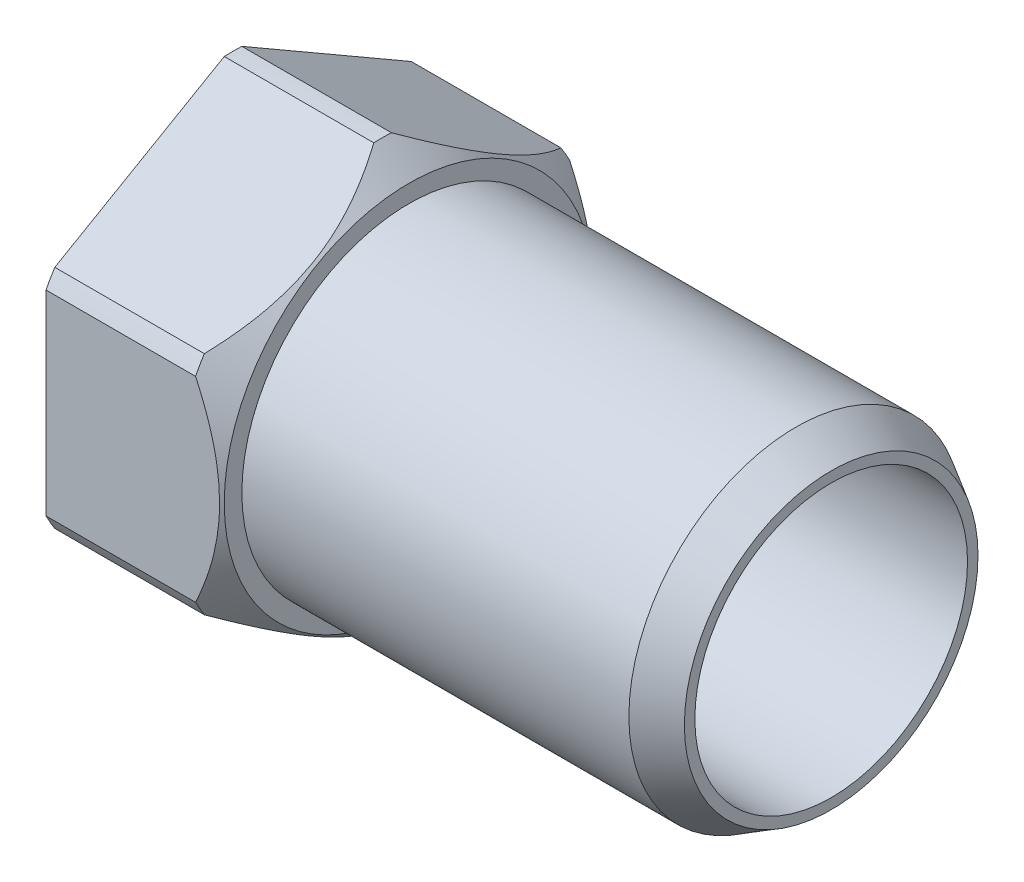
ISO-10303-21;
HEADER;
FILE_DESCRIPTION(('STEP AP214'),'2;1');
FILE_NAME('part.step','',(''),(''),'','','');
FILE_SCHEMA(('AUTOMOTIVE_DESIGN { 1 0 10303 214 1 1 1 1 }'));
ENDSEC;
DATA;
#1=APPLICATION_CONTEXT('core data for automotive mechanical design processes');
#2=APPLICATION_PROTOCOL_DEFINITION('international standard','automotive_design',2000,#1);
#3=PRODUCT_CONTEXT('',#1,'mechanical');
#4=PRODUCT('Part','Part','',(#3));
#5=PRODUCT_RELATED_PRODUCT_CATEGORY('part','',(#4));
#6=PRODUCT_DEFINITION_FORMATION('','',#4);
#7=PRODUCT_DEFINITION_CONTEXT('part definition',#1,'design');
#8=PRODUCT_DEFINITION('design','',#6,#7);
#9=PRODUCT_DEFINITION_SHAPE('','',#8);
#10=(LENGTH_UNIT() NAMED_UNIT(*) SI_UNIT(.MILLI.,.METRE.));
#11=(NAMED_UNIT(*) PLANE_ANGLE_UNIT() SI_UNIT($,.RADIAN.));
#12=(NAMED_UNIT(*) SI_UNIT($,.STERADIAN.) SOLID_ANGLE_UNIT());
#13=UNCERTAINTY_MEASURE_WITH_UNIT(LENGTH_MEASURE(1.E-05),#10,'distance_accuracy_value','');
#14=(GEOMETRIC_REPRESENTATION_CONTEXT(3) GLOBAL_UNCERTAINTY_ASSIGNED_CONTEXT((#13)) GLOBAL_UNIT_ASSIGNED_CONTEXT((#10,
#11,#12)) REPRESENTATION_CONTEXT('',''));
#15=CARTESIAN_POINT('',(0.,0.,0.));
#16=DIRECTION('',(0.,0.,1.));
#17=DIRECTION('',(1.,0.,0.));
#18=AXIS2_PLACEMENT_3D('',#15,#16,#17);
#19=CARTESIAN_POINT('',(0.,0.609600000000002,0.));
#20=DIRECTION('',(1.,0.,0.));
#21=DIRECTION('',(0.,0.,-1.));
#22=AXIS2_PLACEMENT_3D('',#19,#20,#21);
#23=PLANE('',#22);
#24=CARTESIAN_POINT('',(0.,0.,0.));
#25=DIRECTION('',(-1.,0.,0.));
#26=DIRECTION('',(0.,0.,1.));
#27=AXIS2_PLACEMENT_3D('',#24,#25,#26);
#28=CIRCLE('',#27,0.4826);
#29=CARTESIAN_POINT('',(0.,0.,0.4826));
#30=VERTEX_POINT('',#29);
#31=EDGE_CURVE('E238',#30,#30,#28,.T.);
#32=ORIENTED_EDGE('',*,*,#31,.F.);
#33=EDGE_LOOP('',(#32));
#34=FACE_BOUND('',#33,.T.);
#35=DIRECTION('',(0.,0.499999999999999,-0.866025403784439));
#36=VECTOR('',#35,1.);
#37=CARTESIAN_POINT('',(0.,0.609070603460717,0.0254));
#38=LINE('',#37,#36);
#39=CARTESIAN_POINT('',(0.,0.326532346986484,0.514770615295299));
#40=VERTEX_POINT('',#39);
#41=CARTESIAN_POINT('',(0.,0.609070603460717,0.0254));
#42=VERTEX_POINT('',#41);
#43=EDGE_CURVE('E242',#40,#42,#38,.T.);
#44=ORIENTED_EDGE('',*,*,#43,.T.);
#45=CARTESIAN_POINT('',(0.,0.,0.));
#46=DIRECTION('',(-1.,0.,0.));
#47=DIRECTION('',(0.,0.,1.));
#48=AXIS2_PLACEMENT_3D('',#45,#46,#47);
#49=CIRCLE('',#48,0.609600000000002);
#50=CARTESIAN_POINT('',(0.,0.609070603460717,-0.0254));
#51=VERTEX_POINT('',#50);
#52=EDGE_CURVE('E130',#42,#51,#49,.T.);
#53=ORIENTED_EDGE('',*,*,#52,.T.);
#54=DIRECTION('',(0.,-0.500000000000003,-0.866025403784437));
#55=VECTOR('',#54,1.);
#56=CARTESIAN_POINT('',(0.,0.326532346986479,-0.514770615295302));
#57=LINE('',#56,#55);
#58=CARTESIAN_POINT('',(0.,0.326532346986479,-0.514770615295302));
#59=VERTEX_POINT('',#58);
#60=EDGE_CURVE('E112',#51,#59,#57,.T.);
#61=ORIENTED_EDGE('',*,*,#60,.T.);
#62=CARTESIAN_POINT('',(0.,0.28253825647423,-0.540170615295301));
#63=VERTEX_POINT('',#62);
#64=EDGE_CURVE('E128',#59,#63,#49,.T.);
#65=ORIENTED_EDGE('',*,*,#64,.T.);
#66=DIRECTION('',(0.,-1.,0.));
#67=VECTOR('',#66,1.);
#68=CARTESIAN_POINT('',(0.,0.28253825647423,-0.540170615295301));
#69=LINE('',#68,#67);
#70=CARTESIAN_POINT('',(0.,-0.282538256474235,-0.540170615295299));
#71=VERTEX_POINT('',#70);
#72=EDGE_CURVE('E131',#63,#71,#69,.T.);
#73=ORIENTED_EDGE('',*,*,#72,.T.);
#74=CARTESIAN_POINT('',(0.,-0.326532346986484,-0.514770615295299));
#75=VERTEX_POINT('',#74);
#76=EDGE_CURVE('E135',#71,#75,#49,.T.);
#77=ORIENTED_EDGE('',*,*,#76,.T.);
#78=DIRECTION('',(0.,-0.499999999999999,0.866025403784439));
#79=VECTOR('',#78,1.);
#80=CARTESIAN_POINT('',(0.,-0.326532346986484,-0.514770615295299));
#81=LINE('',#80,#79);
#82=CARTESIAN_POINT('',(0.,-0.609070603460717,-0.0254));
#83=VERTEX_POINT('',#82);
#84=EDGE_CURVE('E269',#75,#83,#81,.T.);
#85=ORIENTED_EDGE('',*,*,#84,.T.);
#86=CARTESIAN_POINT('',(0.,-0.609070603460717,0.0253999999999999));
#87=VERTEX_POINT('',#86);
#88=EDGE_CURVE('E139',#83,#87,#49,.T.);
#89=ORIENTED_EDGE('',*,*,#88,.T.);
#90=DIRECTION('',(0.,0.500000000000003,0.866025403784437));
#91=VECTOR('',#90,1.);
#92=CARTESIAN_POINT('',(0.,-0.609070603460717,0.0254));
#93=LINE('',#92,#91);
#94=CARTESIAN_POINT('',(0.,-0.32653234698648,0.514770615295301));
#95=VERTEX_POINT('',#94);
#96=EDGE_CURVE('E266',#87,#95,#93,.T.);
#97=ORIENTED_EDGE('',*,*,#96,.T.);
#98=CARTESIAN_POINT('',(0.,-0.28253825647423,0.540170615295301));
#99=VERTEX_POINT('',#98);
#100=EDGE_CURVE('E144',#95,#99,#49,.T.);
#101=ORIENTED_EDGE('',*,*,#100,.T.);
#102=DIRECTION('',(0.,1.,0.));
#103=VECTOR('',#102,1.);
#104=CARTESIAN_POINT('',(0.,0.282538256474235,0.540170615295299));
#105=LINE('',#104,#103);
#106=CARTESIAN_POINT('',(0.,0.282538256474235,0.540170615295299));
#107=VERTEX_POINT('',#106);
#108=EDGE_CURVE('E263',#99,#107,#105,.T.);
#109=ORIENTED_EDGE('',*,*,#108,.T.);
#110=EDGE_CURVE('E137',#107,#40,#49,.T.);
#111=ORIENTED_EDGE('',*,*,#110,.T.);
#112=EDGE_LOOP('',(#44,#53,#61,#65,#73,#77,#85,#89,#97,#101,#109,#111));
#113=FACE_BOUND('',#112,.T.);
#114=ADVANCED_FACE('F16',(#34,#113),#23,.F.);
#115=CARTESIAN_POINT('',(0.,0.,0.));
#116=DIRECTION('',(-1.,0.,0.));
#117=DIRECTION('',(0.,0.,1.));
#118=AXIS2_PLACEMENT_3D('',#115,#116,#117);
#119=CYLINDRICAL_SURFACE('',#118,0.609600000000002);
#120=DIRECTION('',(-1.,0.,0.));
#121=VECTOR('',#120,1.);
#122=CARTESIAN_POINT('',(0.6096,0.609070603460717,0.0254));
#123=LINE('',#122,#121);
#124=CARTESIAN_POINT('',(0.431800000000003,0.609070603460717,0.0254));
#125=VERTEX_POINT('',#124);
#126=EDGE_CURVE('E241',#125,#42,#123,.T.);
#127=ORIENTED_EDGE('',*,*,#126,.F.);
#128=CARTESIAN_POINT('',(0.431800000000003,0.,0.));
#129=DIRECTION('',(-1.,0.,0.));
#130=DIRECTION('',(0.,0.,1.));
#131=AXIS2_PLACEMENT_3D('',#128,#129,#130);
#132=CIRCLE('',#131,0.609600000000002);
#133=CARTESIAN_POINT('',(0.431800000000003,0.609070603460717,-0.0253999999999999));
#134=VERTEX_POINT('',#133);
#135=EDGE_CURVE('E325',#125,#134,#132,.T.);
#136=ORIENTED_EDGE('',*,*,#135,.T.);
#137=DIRECTION('',(-1.,0.,0.));
#138=VECTOR('',#137,1.);
#139=CARTESIAN_POINT('',(0.6096,0.609070603460717,-0.0254));
#140=LINE('',#139,#138);
#141=EDGE_CURVE('E121',#134,#51,#140,.T.);
#142=ORIENTED_EDGE('',*,*,#141,.T.);
#143=ORIENTED_EDGE('',*,*,#52,.F.);
#144=EDGE_LOOP('',(#127,#136,#142,#143));
#145=FACE_BOUND('',#144,.T.);
#146=ADVANCED_FACE('F197',(#145),#119,.T.);
#147=DIRECTION('',(-1.,0.,0.));
#148=VECTOR('',#147,1.);
#149=CARTESIAN_POINT('',(0.6096,0.326532346986484,0.514770615295299));
#150=LINE('',#149,#148);
#151=CARTESIAN_POINT('',(0.431800000000003,0.326532346986484,0.514770615295299));
#152=VERTEX_POINT('',#151);
#153=EDGE_CURVE('E258',#152,#40,#150,.T.);
#154=ORIENTED_EDGE('',*,*,#153,.T.);
#155=ORIENTED_EDGE('',*,*,#110,.F.);
#156=DIRECTION('',(-1.,0.,0.));
#157=VECTOR('',#156,1.);
#158=CARTESIAN_POINT('',(0.6096,0.282538256474235,0.540170615295299));
#159=LINE('',#158,#157);
#160=CARTESIAN_POINT('',(0.431800000000003,0.282538256474235,0.540170615295299));
#161=VERTEX_POINT('',#160);
#162=EDGE_CURVE('E256',#161,#107,#159,.T.);
#163=ORIENTED_EDGE('',*,*,#162,.F.);
#164=EDGE_CURVE('E145',#161,#152,#132,.T.);
#165=ORIENTED_EDGE('',*,*,#164,.T.);
#166=EDGE_LOOP('',(#154,#155,#163,#165));
#167=FACE_BOUND('',#166,.T.);
#168=ADVANCED_FACE('F204',(#167),#119,.T.);
#169=DIRECTION('',(-1.,0.,0.));
#170=VECTOR('',#169,1.);
#171=CARTESIAN_POINT('',(0.6096,-0.28253825647423,0.540170615295301));
#172=LINE('',#171,#170);
#173=CARTESIAN_POINT('',(0.431800000000003,-0.28253825647423,0.540170615295301));
#174=VERTEX_POINT('',#173);
#175=EDGE_CURVE('E37',#174,#99,#172,.T.);
#176=ORIENTED_EDGE('',*,*,#175,.T.);
#177=ORIENTED_EDGE('',*,*,#100,.F.);
#178=DIRECTION('',(-1.,0.,0.));
#179=VECTOR('',#178,1.);
#180=CARTESIAN_POINT('',(0.6096,-0.32653234698648,0.514770615295301));
#181=LINE('',#180,#179);
#182=CARTESIAN_POINT('',(0.431800000000003,-0.32653234698648,0.514770615295301));
#183=VERTEX_POINT('',#182);
#184=EDGE_CURVE('E253',#183,#95,#181,.T.);
#185=ORIENTED_EDGE('',*,*,#184,.F.);
#186=EDGE_CURVE('E231',#183,#174,#132,.T.);
#187=ORIENTED_EDGE('',*,*,#186,.T.);
#188=EDGE_LOOP('',(#176,#177,#185,#187));
#189=FACE_BOUND('',#188,.T.);
#190=ADVANCED_FACE('F376',(#189),#119,.T.);
#191=DIRECTION('',(-1.,0.,0.));
#192=VECTOR('',#191,1.);
#193=CARTESIAN_POINT('',(0.6096,-0.609070603460717,0.0253999999999999));
#194=LINE('',#193,#192);
#195=CARTESIAN_POINT('',(0.431800000000003,-0.609070603460717,0.0253999999999999));
#196=VERTEX_POINT('',#195);
#197=EDGE_CURVE('E45',#196,#87,#194,.T.);
#198=ORIENTED_EDGE('',*,*,#197,.T.);
#199=ORIENTED_EDGE('',*,*,#88,.F.);
#200=DIRECTION('',(-1.,0.,0.));
#201=VECTOR('',#200,1.);
#202=CARTESIAN_POINT('',(0.6096,-0.609070603460717,-0.0254));
#203=LINE('',#202,#201);
#204=CARTESIAN_POINT('',(0.431800000000003,-0.609070603460717,-0.0254));
#205=VERTEX_POINT('',#204);
#206=EDGE_CURVE('E250',#205,#83,#203,.T.);
#207=ORIENTED_EDGE('',*,*,#206,.F.);
#208=EDGE_CURVE('E290',#205,#196,#132,.T.);
#209=ORIENTED_EDGE('',*,*,#208,.T.);
#210=EDGE_LOOP('',(#198,#199,#207,#209));
#211=FACE_BOUND('',#210,.T.);
#212=ADVANCED_FACE('F385',(#211),#119,.T.);
#213=DIRECTION('',(-1.,0.,0.));
#214=VECTOR('',#213,1.);
#215=CARTESIAN_POINT('',(0.6096,-0.326532346986484,-0.514770615295299));
#216=LINE('',#215,#214);
#217=CARTESIAN_POINT('',(0.431800000000003,-0.326532346986484,-0.514770615295299));
#218=VERTEX_POINT('',#217);
#219=EDGE_CURVE('E247',#218,#75,#216,.T.);
#220=ORIENTED_EDGE('',*,*,#219,.T.);
#221=ORIENTED_EDGE('',*,*,#76,.F.);
#222=DIRECTION('',(-1.,0.,0.));
#223=VECTOR('',#222,1.);
#224=CARTESIAN_POINT('',(0.6096,-0.282538256474235,-0.540170615295299));
#225=LINE('',#224,#223);
#226=CARTESIAN_POINT('',(0.431800000000003,-0.282538256474235,-0.540170615295299));
#227=VERTEX_POINT('',#226);
#228=EDGE_CURVE('E245',#227,#71,#225,.T.);
#229=ORIENTED_EDGE('',*,*,#228,.F.);
#230=EDGE_CURVE('E279',#227,#218,#132,.T.);
#231=ORIENTED_EDGE('',*,*,#230,.T.);
#232=EDGE_LOOP('',(#220,#221,#229,#231));
#233=FACE_BOUND('',#232,.T.);
#234=ADVANCED_FACE('F276',(#233),#119,.T.);
#235=DIRECTION('',(-1.,0.,0.));
#236=VECTOR('',#235,1.);
#237=CARTESIAN_POINT('',(0.6096,0.28253825647423,-0.540170615295301));
#238=LINE('',#237,#236);
#239=CARTESIAN_POINT('',(0.431800000000003,0.28253825647423,-0.540170615295301));
#240=VERTEX_POINT('',#239);
#241=EDGE_CURVE('E120',#240,#63,#238,.T.);
#242=ORIENTED_EDGE('',*,*,#241,.T.);
#243=ORIENTED_EDGE('',*,*,#64,.F.);
#244=DIRECTION('',(-1.,0.,0.));
#245=VECTOR('',#244,1.);
#246=CARTESIAN_POINT('',(0.6096,0.326532346986479,-0.514770615295302));
#247=LINE('',#246,#245);
#248=CARTESIAN_POINT('',(0.431800000000003,0.326532346986479,-0.514770615295302));
#249=VERTEX_POINT('',#248);
#250=EDGE_CURVE('E109',#249,#59,#247,.T.);
#251=ORIENTED_EDGE('',*,*,#250,.F.);
#252=EDGE_CURVE('E328',#249,#240,#132,.T.);
#253=ORIENTED_EDGE('',*,*,#252,.T.);
#254=EDGE_LOOP('',(#242,#243,#251,#253));
#255=FACE_BOUND('',#254,.T.);
#256=ADVANCED_FACE('F134',(#255),#119,.T.);
#257=CARTESIAN_POINT('',(0.508000000000002,0.,0.));
#258=DIRECTION('',(-1.,0.,0.));
#259=DIRECTION('',(0.,0.,1.));
#260=AXIS2_PLACEMENT_3D('',#257,#258,#259);
#261=CONICAL_SURFACE('',#260,0.533400000000003,0.785398163397448);
#262=CARTESIAN_POINT('',(0.508000000000002,0.,0.));
#263=DIRECTION('',(-1.,0.,0.));
#264=DIRECTION('',(0.,0.,1.));
#265=AXIS2_PLACEMENT_3D('',#262,#263,#264);
#266=CIRCLE('',#265,0.533400000000003);
#267=CARTESIAN_POINT('',(0.508000000000002,0.,0.533400000000003));
#268=VERTEX_POINT('',#267);
#269=EDGE_CURVE('E227',#268,#268,#266,.T.);
#270=ORIENTED_EDGE('',*,*,#269,.T.);
#271=EDGE_LOOP('',(#270));
#272=FACE_BOUND('',#271,.T.);
#273=CARTESIAN_POINT('',(0.431692929215943,0.326416876932646,0.514970615295299));
#274=CARTESIAN_POINT('',(0.440886967914297,0.336333396319549,0.497794699882941));
#275=CARTESIAN_POINT('',(0.449475806531747,0.346407113860765,0.480346509280458));
#276=CARTESIAN_POINT('',(0.46508009675136,0.366902608468003,0.444847271294467));
#277=CARTESIAN_POINT('',(0.472088517898941,0.377325712715323,0.426793925165523));
#278=CARTESIAN_POINT('',(0.484001425954382,0.398325306016045,0.390421562630388));
#279=CARTESIAN_POINT('',(0.488932837513431,0.40889787031618,0.372109344096265));
#280=CARTESIAN_POINT('',(0.496432805637492,0.430236176272135,0.335150314033103));
#281=CARTESIAN_POINT('',(0.499005589534026,0.441001536922667,0.316504162424578));
#282=CARTESIAN_POINT('',(0.501454432188988,0.461715689478331,0.280626197762434));
#283=CARTESIAN_POINT('',(0.501536087725195,0.471658310429958,0.263405073113818));
#284=CARTESIAN_POINT('',(0.499518956380617,0.491489950970962,0.229055664099355));
#285=CARTESIAN_POINT('',(0.497419000413574,0.501378938963348,0.211927434461105));
#286=CARTESIAN_POINT('',(0.488076538517155,0.530799664656645,0.160969242764768));
#287=CARTESIAN_POINT('',(0.477792731388507,0.550099003493316,0.127541807347166));
#288=CARTESIAN_POINT('',(0.45985270188708,0.575716465054386,0.0831710623624503));
#289=CARTESIAN_POINT('',(0.454654358572233,0.582518078715095,0.0713903219286482));
#290=CARTESIAN_POINT('',(0.443623696171786,0.595960913507182,0.0481066490709974));
#291=CARTESIAN_POINT('',(0.437793942286801,0.602602658882505,0.0366028086300039));
#292=CARTESIAN_POINT('',(0.431692929216039,0.609186073514572,0.0251999999999708));
#293=B_SPLINE_CURVE_WITH_KNOTS('',3,(#273,#274,#275,#276,#277,#278,#279,#280,#281,#282,#283,
#284,#285,#286,#287,#288,#289,#290,#291,#292),.UNSPECIFIED.,.F.,.F.,(4,2,2,2,2,2,2,2,2,4),(0.,
0.0656176142567916,0.131521608604223,0.196542820832239,0.261447267417734,0.32097915412989,
0.380542959370502,0.499589128188417,0.543272980061427,0.586785582444908),.UNSPECIFIED.);
#294=EDGE_CURVE('E11',#152,#125,#293,.T.);
#295=ORIENTED_EDGE('',*,*,#294,.F.);
#296=ORIENTED_EDGE('',*,*,#164,.F.);
#297=CARTESIAN_POINT('',(0.234519712816562,-0.599392612747879,0.540170615295303));
#298=CARTESIAN_POINT('',(0.256322038991689,-0.569976111200741,0.540170615295303));
#299=CARTESIAN_POINT('',(0.277736564815772,-0.540239138748512,0.540170615295303));
#300=CARTESIAN_POINT('',(0.319386368958454,-0.479613557617318,0.540170615295302));
#301=CARTESIAN_POINT('',(0.339611135548577,-0.448717770495109,0.540170615295302));
#302=CARTESIAN_POINT('',(0.379125506379862,-0.3840685683185,0.540170615295302));
#303=CARTESIAN_POINT('',(0.39831103751862,-0.350250189146901,0.540170615295302));
#304=CARTESIAN_POINT('',(0.433256092102638,-0.280976016030553,0.540170615295302));
#305=CARTESIAN_POINT('',(0.449027122908795,-0.245526226001993,0.540170615295301));
#306=CARTESIAN_POINT('',(0.474470607960292,-0.175009525575883,0.540170615295301));
#307=CARTESIAN_POINT('',(0.484472931664772,-0.14006760212276,0.540170615295301));
#308=CARTESIAN_POINT('',(0.497851200308203,-0.069481439333855,0.540170615295301));
#309=CARTESIAN_POINT('',(0.501339768200981,-0.0338601070637596,0.5401706152953));
#310=CARTESIAN_POINT('',(0.50111684835129,0.0362541466784603,0.5401706152953));
#311=CARTESIAN_POINT('',(0.497624383781466,0.0707479440345899,0.5401706152953));
#312=CARTESIAN_POINT('',(0.484637269683768,0.139128574723412,0.5401706152953));
#313=CARTESIAN_POINT('',(0.475039643299255,0.172994527470341,0.5401706152953));
#314=CARTESIAN_POINT('',(0.450001083515333,0.243282153212106,0.540170615295299));
#315=CARTESIAN_POINT('',(0.433974780411505,0.279485589301147,0.540170615295299));
#316=CARTESIAN_POINT('',(0.398368364455073,0.350200979503021,0.540170615295299));
#317=CARTESIAN_POINT('',(0.378775256060846,0.384706141933621,0.540170615295299));
#318=CARTESIAN_POINT('',(0.338404140699831,0.450628505350918,0.540170615295298));
#319=CARTESIAN_POINT('',(0.317734968601578,0.482113770292281,0.540170615295298));
#320=CARTESIAN_POINT('',(0.275173288876114,0.543868993335321,0.540170615295298));
#321=CARTESIAN_POINT('',(0.253292307424044,0.574146846687989,0.540170615295298));
#322=CARTESIAN_POINT('',(0.231018636046439,0.604097393981088,0.540170615295298));
#323=B_SPLINE_CURVE_WITH_KNOTS('',3,(#297,#298,#299,#300,#301,#302,#303,#304,#305,#306,#307,
#308,#309,#310,#311,#312,#313,#314,#315,#316,#317,#318,#319,#320,#321,#322),.UNSPECIFIED.,.F.,
.F.,(4,2,2,2,2,2,2,2,2,2,2,2,4),(0.,0.109882288663104,0.220622438802764,0.337148616228361,
0.453275750108951,0.561851906778058,0.668532745714669,0.771919096087748,0.87709727042663,
0.995573555074897,1.11449047311352,1.22743860912506,1.33945298405168),.UNSPECIFIED.);
#324=EDGE_CURVE('E30',#174,#161,#323,.T.);
#325=ORIENTED_EDGE('',*,*,#324,.F.);
#326=ORIENTED_EDGE('',*,*,#186,.F.);
#327=CARTESIAN_POINT('',(0.431692929215943,-0.609186073514555,0.0251999999999999));
#328=CARTESIAN_POINT('',(0.440886967914297,-0.599269554127652,0.0423759154123576));
#329=CARTESIAN_POINT('',(0.449475806531747,-0.589195836586436,0.0598241060148407));
#330=CARTESIAN_POINT('',(0.46508009675136,-0.568700341979198,0.095323344000832));
#331=CARTESIAN_POINT('',(0.472088517898942,-0.558277237731878,0.113376690129777));
#332=CARTESIAN_POINT('',(0.484001425954383,-0.537277644431155,0.149749052664911));
#333=CARTESIAN_POINT('',(0.488932837513432,-0.52670508013102,0.168061271199034));
#334=CARTESIAN_POINT('',(0.496432805637493,-0.505366774175065,0.205020301262197));
#335=CARTESIAN_POINT('',(0.499005589534028,-0.494601413524533,0.223666452870721));
#336=CARTESIAN_POINT('',(0.501454432188989,-0.473887260968868,0.259544417532866));
#337=CARTESIAN_POINT('',(0.501536087725196,-0.463944640017241,0.276765542181482));
#338=CARTESIAN_POINT('',(0.499518956380619,-0.444112999476237,0.311114951195944));
#339=CARTESIAN_POINT('',(0.497419000413575,-0.434224011483851,0.328243180834194));
#340=CARTESIAN_POINT('',(0.488076538517157,-0.404803285790554,0.379201372530531));
#341=CARTESIAN_POINT('',(0.477792731388508,-0.385503946953883,0.412628807948134));
#342=CARTESIAN_POINT('',(0.459852701887081,-0.359886485392812,0.45699955293285));
#343=CARTESIAN_POINT('',(0.454654358572234,-0.353084871732103,0.468780293366652));
#344=CARTESIAN_POINT('',(0.443623696171786,-0.339642036940015,0.492063966224303));
#345=CARTESIAN_POINT('',(0.437793942286802,-0.333000291564693,0.503567806665297));
#346=CARTESIAN_POINT('',(0.431692929216039,-0.326416876932625,0.51497061529533));
#347=B_SPLINE_CURVE_WITH_KNOTS('',3,(#327,#328,#329,#330,#331,#332,#333,#334,#335,#336,#337,
#338,#339,#340,#341,#342,#343,#344,#345,#346),.UNSPECIFIED.,.F.,.F.,(4,2,2,2,2,2,2,2,2,4),(0.,
0.065617614256792,0.131521608604224,0.19654282083224,0.261447267417736,0.320979154129892,
0.380542959370505,0.499589128188419,0.543272980061431,0.586785582444913),.UNSPECIFIED.);
#348=EDGE_CURVE('E291',#196,#183,#347,.T.);
#349=ORIENTED_EDGE('',*,*,#348,.F.);
#350=ORIENTED_EDGE('',*,*,#208,.F.);
#351=CARTESIAN_POINT('',(0.431692929215943,-0.326416876932646,-0.514970615295299));
#352=CARTESIAN_POINT('',(0.440886967914297,-0.336333396319549,-0.497794699882941));
#353=CARTESIAN_POINT('',(0.449475806531747,-0.346407113860765,-0.480346509280458));
#354=CARTESIAN_POINT('',(0.46508009675136,-0.366902608468003,-0.444847271294467));
#355=CARTESIAN_POINT('',(0.472088517898941,-0.377325712715323,-0.426793925165522));
#356=CARTESIAN_POINT('',(0.484001425954382,-0.398325306016045,-0.390421562630388));
#357=CARTESIAN_POINT('',(0.488932837513431,-0.40889787031618,-0.372109344096265));
#358=CARTESIAN_POINT('',(0.496432805637492,-0.430236176272135,-0.335150314033102));
#359=CARTESIAN_POINT('',(0.499005589534026,-0.441001536922667,-0.316504162424578));
#360=CARTESIAN_POINT('',(0.501454432188988,-0.461715689478331,-0.280626197762434));
#361=CARTESIAN_POINT('',(0.501536087725195,-0.471658310429958,-0.263405073113818));
#362=CARTESIAN_POINT('',(0.499518956380617,-0.491489950970962,-0.229055664099355));
#363=CARTESIAN_POINT('',(0.497419000413574,-0.501378938963348,-0.211927434461105));
#364=CARTESIAN_POINT('',(0.488076538517155,-0.530799664656645,-0.160969242764769));
#365=CARTESIAN_POINT('',(0.477792731388507,-0.550099003493316,-0.127541807347166));
#366=CARTESIAN_POINT('',(0.45985270188708,-0.575716465054386,-0.0831710623624503));
#367=CARTESIAN_POINT('',(0.454654358572233,-0.582518078715095,-0.0713903219286481));
#368=CARTESIAN_POINT('',(0.443623696171786,-0.595960913507182,-0.0481066490709974));
#369=CARTESIAN_POINT('',(0.437793942286801,-0.602602658882505,-0.0366028086300039));
#370=CARTESIAN_POINT('',(0.431692929216039,-0.609186073514572,-0.0251999999999708));
#371=B_SPLINE_CURVE_WITH_KNOTS('',3,(#351,#352,#353,#354,#355,#356,#357,#358,#359,#360,#361,
#362,#363,#364,#365,#366,#367,#368,#369,#370),.UNSPECIFIED.,.F.,.F.,(4,2,2,2,2,2,2,2,2,4),(0.,
0.0656176142567916,0.131521608604223,0.196542820832239,0.261447267417734,0.32097915412989,
0.380542959370502,0.499589128188417,0.543272980061428,0.586785582444908),.UNSPECIFIED.);
#372=EDGE_CURVE('E283',#218,#205,#371,.T.);
#373=ORIENTED_EDGE('',*,*,#372,.F.);
#374=ORIENTED_EDGE('',*,*,#230,.F.);
#375=CARTESIAN_POINT('',(0.234519712816562,-0.599392612747884,-0.540170615295298));
#376=CARTESIAN_POINT('',(0.256322038991688,-0.569976111200745,-0.540170615295298));
#377=CARTESIAN_POINT('',(0.277736564815772,-0.540239138748517,-0.540170615295298));
#378=CARTESIAN_POINT('',(0.319386368958454,-0.479613557617323,-0.540170615295298));
#379=CARTESIAN_POINT('',(0.339611135548577,-0.448717770495114,-0.540170615295298));
#380=CARTESIAN_POINT('',(0.379125506379862,-0.384068568318505,-0.540170615295299));
#381=CARTESIAN_POINT('',(0.39831103751862,-0.350250189146906,-0.540170615295299));
#382=CARTESIAN_POINT('',(0.433256092102638,-0.280976016030558,-0.540170615295299));
#383=CARTESIAN_POINT('',(0.449027122908795,-0.245526226001998,-0.540170615295299));
#384=CARTESIAN_POINT('',(0.474470607960292,-0.175009525575888,-0.540170615295299));
#385=CARTESIAN_POINT('',(0.484472931664772,-0.140067602122764,-0.5401706152953));
#386=CARTESIAN_POINT('',(0.497851200308203,-0.0694814393338598,-0.5401706152953));
#387=CARTESIAN_POINT('',(0.501339768200982,-0.0338601070637643,-0.5401706152953));
#388=CARTESIAN_POINT('',(0.501116848351291,0.0362541466784556,-0.5401706152953));
#389=CARTESIAN_POINT('',(0.497624383781467,0.0707479440345852,-0.5401706152953));
#390=CARTESIAN_POINT('',(0.484637269683768,0.139128574723408,-0.540170615295301));
#391=CARTESIAN_POINT('',(0.475039643299255,0.172994527470336,-0.540170615295301));
#392=CARTESIAN_POINT('',(0.450001083515333,0.243282153212101,-0.540170615295301));
#393=CARTESIAN_POINT('',(0.433974780411505,0.279485589301143,-0.540170615295301));
#394=CARTESIAN_POINT('',(0.398368364455073,0.350200979503017,-0.540170615295301));
#395=CARTESIAN_POINT('',(0.378775256060846,0.384706141933616,-0.540170615295302));
#396=CARTESIAN_POINT('',(0.338404140699832,0.450628505350914,-0.540170615295302));
#397=CARTESIAN_POINT('',(0.317734968601578,0.482113770292277,-0.540170615295302));
#398=CARTESIAN_POINT('',(0.275173288876114,0.543868993335316,-0.540170615295302));
#399=CARTESIAN_POINT('',(0.253292307424044,0.574146846687985,-0.540170615295302));
#400=CARTESIAN_POINT('',(0.231018636046439,0.604097393981083,-0.540170615295302));
#401=B_SPLINE_CURVE_WITH_KNOTS('',3,(#375,#376,#377,#378,#379,#380,#381,#382,#383,#384,#385,
#386,#387,#388,#389,#390,#391,#392,#393,#394,#395,#396,#397,#398,#399,#400),.UNSPECIFIED.,.F.,
.F.,(4,2,2,2,2,2,2,2,2,2,2,2,4),(0.,0.109882288663105,0.220622438802764,0.337148616228361,
0.453275750108952,0.561851906778058,0.66853274571467,0.771919096087749,0.877097270426631,
0.995573555074898,1.11449047311353,1.22743860912506,1.33945298405168),.UNSPECIFIED.);
#402=EDGE_CURVE('E158',#240,#227,#401,.F.);
#403=ORIENTED_EDGE('',*,*,#402,.F.);
#404=ORIENTED_EDGE('',*,*,#252,.F.);
#405=CARTESIAN_POINT('',(0.431692929215943,0.609186073514555,-0.0252));
#406=CARTESIAN_POINT('',(0.440886967914297,0.599269554127652,-0.0423759154123577));
#407=CARTESIAN_POINT('',(0.449475806531747,0.589195836586436,-0.0598241060148408));
#408=CARTESIAN_POINT('',(0.46508009675136,0.568700341979198,-0.0953233440008321));
#409=CARTESIAN_POINT('',(0.472088517898942,0.558277237731878,-0.113376690129777));
#410=CARTESIAN_POINT('',(0.484001425954383,0.537277644431155,-0.149749052664911));
#411=CARTESIAN_POINT('',(0.488932837513432,0.52670508013102,-0.168061271199035));
#412=CARTESIAN_POINT('',(0.496432805637493,0.505366774175065,-0.205020301262197));
#413=CARTESIAN_POINT('',(0.499005589534028,0.494601413524533,-0.223666452870721));
#414=CARTESIAN_POINT('',(0.501454432188989,0.473887260968868,-0.259544417532866));
#415=CARTESIAN_POINT('',(0.501536087725196,0.463944640017241,-0.276765542181482));
#416=CARTESIAN_POINT('',(0.499518956380619,0.444112999476236,-0.311114951195944));
#417=CARTESIAN_POINT('',(0.497419000413576,0.434224011483851,-0.328243180834194));
#418=CARTESIAN_POINT('',(0.488076538517157,0.404803285790554,-0.379201372530531));
#419=CARTESIAN_POINT('',(0.477792731388508,0.385503946953882,-0.412628807948134));
#420=CARTESIAN_POINT('',(0.459852701887081,0.359886485392812,-0.45699955293285));
#421=CARTESIAN_POINT('',(0.454654358572234,0.353084871732103,-0.468780293366652));
#422=CARTESIAN_POINT('',(0.443623696171786,0.339642036940015,-0.492063966224304));
#423=CARTESIAN_POINT('',(0.437793942286802,0.333000291564692,-0.503567806665298));
#424=CARTESIAN_POINT('',(0.431692929216039,0.326416876932625,-0.514970615295331));
#425=B_SPLINE_CURVE_WITH_KNOTS('',3,(#405,#406,#407,#408,#409,#410,#411,#412,#413,#414,#415,
#416,#417,#418,#419,#420,#421,#422,#423,#424),.UNSPECIFIED.,.F.,.F.,(4,2,2,2,2,2,2,2,2,4),(0.,
0.065617614256792,0.131521608604224,0.19654282083224,0.261447267417736,0.320979154129892,
0.380542959370505,0.49958912818842,0.543272980061432,0.586785582444914),.UNSPECIFIED.);
#426=EDGE_CURVE('E115',#134,#249,#425,.T.);
#427=ORIENTED_EDGE('',*,*,#426,.F.);
#428=ORIENTED_EDGE('',*,*,#135,.F.);
#429=EDGE_LOOP('',(#295,#296,#325,#326,#349,#350,#373,#374,#403,#404,#427,#428));
#430=FACE_BOUND('',#429,.T.);
#431=ADVANCED_FACE('F165',(#272,#430),#261,.T.);
#432=CARTESIAN_POINT('',(0.,0.,0.));
#433=DIRECTION('',(-1.,0.,0.));
#434=DIRECTION('',(0.,0.,1.));
#435=AXIS2_PLACEMENT_3D('',#432,#433,#434);
#436=CYLINDRICAL_SURFACE('',#435,0.4826);
#437=CARTESIAN_POINT('',(0.508000000000002,0.,0.));
#438=DIRECTION('',(-1.,0.,0.));
#439=DIRECTION('',(0.,0.,1.));
#440=AXIS2_PLACEMENT_3D('',#437,#438,#439);
#441=CIRCLE('',#440,0.4826);
#442=CARTESIAN_POINT('',(0.508000000000002,0.,0.4826));
#443=VERTEX_POINT('',#442);
#444=EDGE_CURVE('E226',#443,#443,#441,.T.);
#445=ORIENTED_EDGE('',*,*,#444,.F.);
#446=EDGE_LOOP('',(#445));
#447=FACE_BOUND('',#446,.T.);
#448=CARTESIAN_POINT('',(1.6256,0.,0.));
#449=DIRECTION('',(-1.,0.,0.));
#450=DIRECTION('',(0.,0.,1.));
#451=AXIS2_PLACEMENT_3D('',#448,#449,#450);
#452=CIRCLE('',#451,0.4826);
#453=CARTESIAN_POINT('',(1.6256,0.,0.4826));
#454=VERTEX_POINT('',#453);
#455=EDGE_CURVE('E149',#454,#454,#452,.T.);
#456=ORIENTED_EDGE('',*,*,#455,.T.);
#457=EDGE_LOOP('',(#456));
#458=FACE_BOUND('',#457,.T.);
#459=ADVANCED_FACE('F18',(#447,#458),#436,.T.);
#460=CARTESIAN_POINT('',(1.7272,0.,0.));
#461=DIRECTION('',(-1.,0.,0.));
#462=DIRECTION('',(0.,0.,1.));
#463=AXIS2_PLACEMENT_3D('',#460,#461,#462);
#464=CONICAL_SURFACE('',#463,0.423941212650332,0.52359877559831);
#465=ORIENTED_EDGE('',*,*,#455,.F.);
#466=EDGE_LOOP('',(#465));
#467=FACE_BOUND('',#466,.T.);
#468=CARTESIAN_POINT('',(1.7272,0.,0.));
#469=DIRECTION('',(-1.,0.,0.));
#470=DIRECTION('',(0.,0.,1.));
#471=AXIS2_PLACEMENT_3D('',#468,#469,#470);
#472=CIRCLE('',#471,0.423941212650332);
#473=CARTESIAN_POINT('',(1.7272,0.,0.423941212650332));
#474=VERTEX_POINT('',#473);
#475=EDGE_CURVE('E143',#474,#474,#472,.T.);
#476=ORIENTED_EDGE('',*,*,#475,.T.);
#477=EDGE_LOOP('',(#476));
#478=FACE_BOUND('',#477,.T.);
#479=ADVANCED_FACE('F191',(#467,#478),#464,.T.);
#480=CARTESIAN_POINT('',(1.7272,0.423941212650332,0.));
#481=DIRECTION('',(-1.,0.,0.));
#482=DIRECTION('',(0.,0.,1.));
#483=AXIS2_PLACEMENT_3D('',#480,#481,#482);
#484=PLANE('',#483);
#485=CARTESIAN_POINT('',(1.7272,0.,0.));
#486=DIRECTION('',(-1.,0.,0.));
#487=DIRECTION('',(0.,0.,1.));
#488=AXIS2_PLACEMENT_3D('',#485,#486,#487);
#489=CIRCLE('',#488,0.3937);
#490=CARTESIAN_POINT('',(1.7272,0.,0.3937));
#491=VERTEX_POINT('',#490);
#492=EDGE_CURVE('E228',#491,#491,#489,.T.);
#493=ORIENTED_EDGE('',*,*,#492,.T.);
#494=EDGE_LOOP('',(#493));
#495=FACE_BOUND('',#494,.T.);
#496=ORIENTED_EDGE('',*,*,#475,.F.);
#497=EDGE_LOOP('',(#496));
#498=FACE_BOUND('',#497,.T.);
#499=ADVANCED_FACE('F184',(#495,#498),#484,.F.);
#500=CARTESIAN_POINT('',(0.508000000000002,0.533400000000003,0.));
#501=DIRECTION('',(-1.,0.,0.));
#502=DIRECTION('',(0.,0.,1.));
#503=AXIS2_PLACEMENT_3D('',#500,#501,#502);
#504=PLANE('',#503);
#505=ORIENTED_EDGE('',*,*,#269,.F.);
#506=EDGE_LOOP('',(#505));
#507=FACE_BOUND('',#506,.T.);
#508=ORIENTED_EDGE('',*,*,#444,.T.);
#509=EDGE_LOOP('',(#508));
#510=FACE_BOUND('',#509,.T.);
#511=ADVANCED_FACE('F181',(#507,#510),#504,.F.);
#512=CARTESIAN_POINT('',(0.,0.,0.));
#513=DIRECTION('',(-1.,0.,0.));
#514=DIRECTION('',(0.,0.,1.));
#515=AXIS2_PLACEMENT_3D('',#512,#513,#514);
#516=CYLINDRICAL_SURFACE('',#515,0.3937);
#517=ORIENTED_EDGE('',*,*,#492,.F.);
#518=EDGE_LOOP('',(#517));
#519=FACE_BOUND('',#518,.T.);
#520=CARTESIAN_POINT('',(0.0888999999999992,0.,0.));
#521=DIRECTION('',(-1.,0.,0.));
#522=DIRECTION('',(0.,0.,1.));
#523=AXIS2_PLACEMENT_3D('',#520,#521,#522);
#524=CIRCLE('',#523,0.3937);
#525=CARTESIAN_POINT('',(0.0888999999999992,0.,0.3937));
#526=VERTEX_POINT('',#525);
#527=EDGE_CURVE('E233',#526,#526,#524,.T.);
#528=ORIENTED_EDGE('',*,*,#527,.T.);
#529=EDGE_LOOP('',(#528));
#530=FACE_BOUND('',#529,.T.);
#531=ADVANCED_FACE('F178',(#519,#530),#516,.F.);
#532=CARTESIAN_POINT('',(0.,0.,0.));
#533=DIRECTION('',(-1.,0.,0.));
#534=DIRECTION('',(0.,0.,1.));
#535=AXIS2_PLACEMENT_3D('',#532,#533,#534);
#536=CONICAL_SURFACE('',#535,0.4826,0.785398163397452);
#537=ORIENTED_EDGE('',*,*,#527,.F.);
#538=EDGE_LOOP('',(#537));
#539=FACE_BOUND('',#538,.T.);
#540=ORIENTED_EDGE('',*,*,#31,.T.);
#541=EDGE_LOOP('',(#540));
#542=FACE_BOUND('',#541,.T.);
#543=ADVANCED_FACE('F173',(#539,#542),#536,.F.);
#544=CARTESIAN_POINT('',(0.6096,0.326532346986479,-0.514770615295302));
#545=DIRECTION('',(0.,0.866025403784437,-0.500000000000003));
#546=DIRECTION('',(0.,0.500000000000003,0.866025403784437));
#547=AXIS2_PLACEMENT_3D('',#544,#545,#546);
#548=PLANE('',#547);
#549=ORIENTED_EDGE('',*,*,#426,.T.);
#550=ORIENTED_EDGE('',*,*,#250,.T.);
#551=ORIENTED_EDGE('',*,*,#60,.F.);
#552=ORIENTED_EDGE('',*,*,#141,.F.);
#553=EDGE_LOOP('',(#549,#550,#551,#552));
#554=FACE_BOUND('',#553,.T.);
#555=ADVANCED_FACE('F111',(#554),#548,.T.);
#556=CARTESIAN_POINT('',(0.6096,0.28253825647423,-0.540170615295301));
#557=DIRECTION('',(0.,0.,-1.));
#558=DIRECTION('',(0.,1.,0.));
#559=AXIS2_PLACEMENT_3D('',#556,#557,#558);
#560=PLANE('',#559);
#561=ORIENTED_EDGE('',*,*,#402,.T.);
#562=ORIENTED_EDGE('',*,*,#228,.T.);
#563=ORIENTED_EDGE('',*,*,#72,.F.);
#564=ORIENTED_EDGE('',*,*,#241,.F.);
#565=EDGE_LOOP('',(#561,#562,#563,#564));
#566=FACE_BOUND('',#565,.T.);
#567=ADVANCED_FACE('F172',(#566),#560,.T.);
#568=CARTESIAN_POINT('',(0.6096,-0.326532346986484,-0.514770615295299));
#569=DIRECTION('',(0.,-0.866025403784439,-0.499999999999999));
#570=DIRECTION('',(0.,0.499999999999999,-0.866025403784439));
#571=AXIS2_PLACEMENT_3D('',#568,#569,#570);
#572=PLANE('',#571);
#573=ORIENTED_EDGE('',*,*,#372,.T.);
#574=ORIENTED_EDGE('',*,*,#206,.T.);
#575=ORIENTED_EDGE('',*,*,#84,.F.);
#576=ORIENTED_EDGE('',*,*,#219,.F.);
#577=EDGE_LOOP('',(#573,#574,#575,#576));
#578=FACE_BOUND('',#577,.T.);
#579=ADVANCED_FACE('F282',(#578),#572,.T.);
#580=CARTESIAN_POINT('',(0.6096,-0.609070603460717,0.0254));
#581=DIRECTION('',(0.,-0.866025403784437,0.500000000000003));
#582=DIRECTION('',(0.,-0.500000000000003,-0.866025403784437));
#583=AXIS2_PLACEMENT_3D('',#580,#581,#582);
#584=PLANE('',#583);
#585=ORIENTED_EDGE('',*,*,#348,.T.);
#586=ORIENTED_EDGE('',*,*,#184,.T.);
#587=ORIENTED_EDGE('',*,*,#96,.F.);
#588=ORIENTED_EDGE('',*,*,#197,.F.);
#589=EDGE_LOOP('',(#585,#586,#587,#588));
#590=FACE_BOUND('',#589,.T.);
#591=ADVANCED_FACE('F304',(#590),#584,.T.);
#592=CARTESIAN_POINT('',(0.6096,0.282538256474235,0.540170615295299));
#593=DIRECTION('',(0.,0.,1.));
#594=DIRECTION('',(0.,-1.,0.));
#595=AXIS2_PLACEMENT_3D('',#592,#593,#594);
#596=PLANE('',#595);
#597=ORIENTED_EDGE('',*,*,#324,.T.);
#598=ORIENTED_EDGE('',*,*,#162,.T.);
#599=ORIENTED_EDGE('',*,*,#108,.F.);
#600=ORIENTED_EDGE('',*,*,#175,.F.);
#601=EDGE_LOOP('',(#597,#598,#599,#600));
#602=FACE_BOUND('',#601,.T.);
#603=ADVANCED_FACE('F308',(#602),#596,.T.);
#604=CARTESIAN_POINT('',(0.6096,0.609070603460717,0.0254));
#605=DIRECTION('',(0.,0.866025403784439,0.499999999999999));
#606=DIRECTION('',(0.,-0.499999999999999,0.866025403784439));
#607=AXIS2_PLACEMENT_3D('',#604,#605,#606);
#608=PLANE('',#607);
#609=ORIENTED_EDGE('',*,*,#294,.T.);
#610=ORIENTED_EDGE('',*,*,#126,.T.);
#611=ORIENTED_EDGE('',*,*,#43,.F.);
#612=ORIENTED_EDGE('',*,*,#153,.F.);
#613=EDGE_LOOP('',(#609,#610,#611,#612));
#614=FACE_BOUND('',#613,.T.);
#615=ADVANCED_FACE('F311',(#614),#608,.T.);
#616=CLOSED_SHELL('',(#114,#146,#168,#190,#212,#234,#256,#431,#459,#479,#499,#511,#531,#543,
#555,#567,#579,#591,#603,#615));
#617=MANIFOLD_SOLID_BREP('B1',#616);
#618=ADVANCED_BREP_SHAPE_REPRESENTATION('',(#18,#617),#14);
#619=SHAPE_DEFINITION_REPRESENTATION(#9,#618);
ENDSEC;
END-ISO-10303-21;
